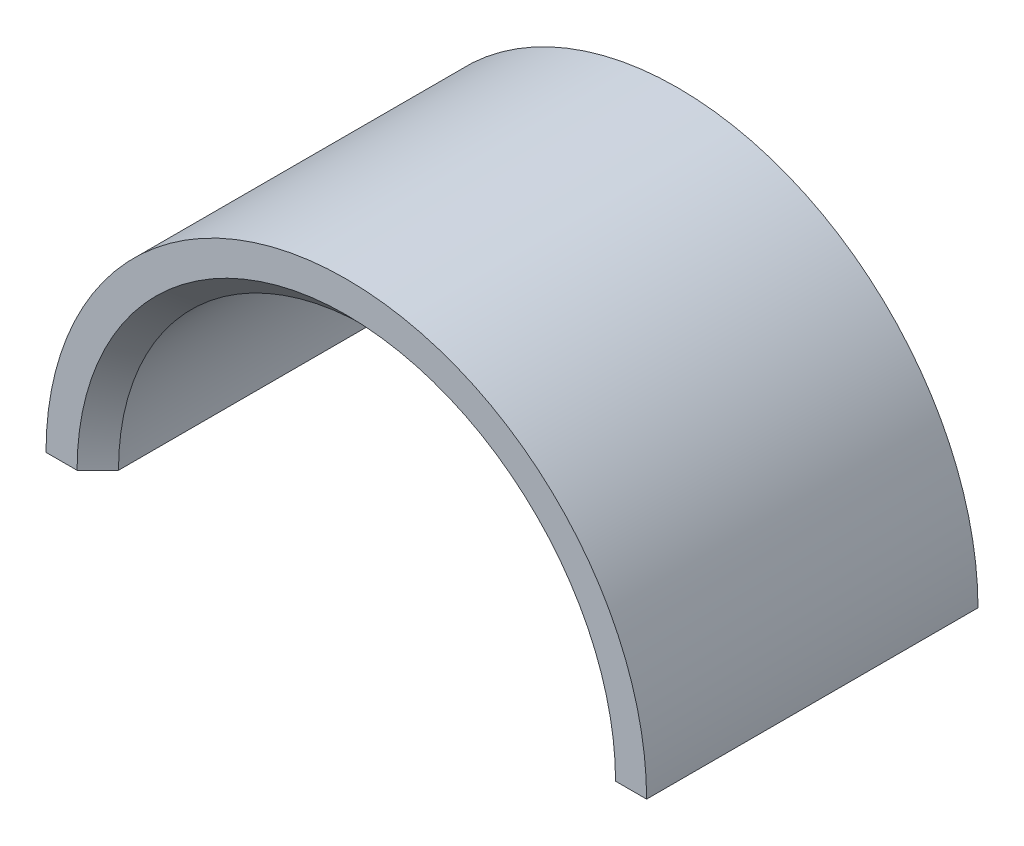
ISO-10303-21;
HEADER;
FILE_DESCRIPTION(('STEP AP214'),'2;1');
FILE_NAME('part.step','',(''),(''),'','','');
FILE_SCHEMA(('AUTOMOTIVE_DESIGN { 1 0 10303 214 1 1 1 1 }'));
ENDSEC;
DATA;
#1=APPLICATION_CONTEXT('core data for automotive mechanical design processes');
#2=APPLICATION_PROTOCOL_DEFINITION('international standard','automotive_design',2000,#1);
#3=PRODUCT_CONTEXT('',#1,'mechanical');
#4=PRODUCT('Part','Part','',(#3));
#5=PRODUCT_RELATED_PRODUCT_CATEGORY('part','',(#4));
#6=PRODUCT_DEFINITION_FORMATION('','',#4);
#7=PRODUCT_DEFINITION_CONTEXT('part definition',#1,'design');
#8=PRODUCT_DEFINITION('design','',#6,#7);
#9=PRODUCT_DEFINITION_SHAPE('','',#8);
#10=(LENGTH_UNIT() NAMED_UNIT(*) SI_UNIT(.MILLI.,.METRE.));
#11=(NAMED_UNIT(*) PLANE_ANGLE_UNIT() SI_UNIT($,.RADIAN.));
#12=(NAMED_UNIT(*) SI_UNIT($,.STERADIAN.) SOLID_ANGLE_UNIT());
#13=UNCERTAINTY_MEASURE_WITH_UNIT(LENGTH_MEASURE(1.E-05),#10,'distance_accuracy_value','');
#14=(GEOMETRIC_REPRESENTATION_CONTEXT(3) GLOBAL_UNCERTAINTY_ASSIGNED_CONTEXT((#13)) GLOBAL_UNIT_ASSIGNED_CONTEXT((#10,
#11,#12)) REPRESENTATION_CONTEXT('',''));
#15=CARTESIAN_POINT('',(0.,0.,0.));
#16=DIRECTION('',(0.,0.,1.));
#17=DIRECTION('',(1.,0.,0.));
#18=AXIS2_PLACEMENT_3D('',#15,#16,#17);
#19=CARTESIAN_POINT('',(34.3713198515824,-30.64120754575,14.01));
#20=DIRECTION('',(0.,-1.,0.));
#21=DIRECTION('',(0.,0.,-1.));
#22=AXIS2_PLACEMENT_3D('',#19,#20,#21);
#23=PLANE('',#22);
#24=DIRECTION('',(1.,0.,0.));
#25=VECTOR('',#24,1.);
#26=CARTESIAN_POINT('',(0.,-30.64120754575,14.));
#27=LINE('',#26,#25);
#28=CARTESIAN_POINT('',(-14.5,-30.64120754575,14.));
#29=VERTEX_POINT('',#28);
#30=CARTESIAN_POINT('',(-13.,-30.64120754575,14.));
#31=VERTEX_POINT('',#30);
#32=EDGE_CURVE('E95',#29,#31,#27,.T.);
#33=ORIENTED_EDGE('',*,*,#32,.F.);
#34=DIRECTION('',(0.,0.,-1.));
#35=VECTOR('',#34,1.);
#36=CARTESIAN_POINT('',(-14.5,-30.64120754575,14.01));
#37=LINE('',#36,#35);
#38=CARTESIAN_POINT('',(-14.5,-30.64120754575,-2.));
#39=VERTEX_POINT('',#38);
#40=EDGE_CURVE('E98',#39,#29,#37,.F.);
#41=ORIENTED_EDGE('',*,*,#40,.F.);
#42=DIRECTION('',(1.,0.,0.));
#43=VECTOR('',#42,1.);
#44=CARTESIAN_POINT('',(0.,-30.64120754575,-2.));
#45=LINE('',#44,#43);
#46=CARTESIAN_POINT('',(-13.,-30.64120754575,-2.));
#47=VERTEX_POINT('',#46);
#48=EDGE_CURVE('E131',#39,#47,#45,.T.);
#49=ORIENTED_EDGE('',*,*,#48,.T.);
#50=DIRECTION('',(-0.707106781186548,0.,-0.707106781186547));
#51=VECTOR('',#50,1.);
#52=CARTESIAN_POINT('',(0.,-30.64120754575,11.));
#53=LINE('',#52,#51);
#54=CARTESIAN_POINT('',(-12.,-30.64120754575,-0.99999999999999));
#55=VERTEX_POINT('',#54);
#56=EDGE_CURVE('E64',#55,#47,#53,.T.);
#57=ORIENTED_EDGE('',*,*,#56,.F.);
#58=DIRECTION('',(0.,0.,-1.));
#59=VECTOR('',#58,1.);
#60=CARTESIAN_POINT('',(-12.,-30.64120754575,12.));
#61=LINE('',#60,#59);
#62=CARTESIAN_POINT('',(-12.,-30.64120754575,13.));
#63=VERTEX_POINT('',#62);
#64=EDGE_CURVE('E129',#63,#55,#61,.T.);
#65=ORIENTED_EDGE('',*,*,#64,.F.);
#66=DIRECTION('',(0.707106781186553,0.,-0.707106781186542));
#67=VECTOR('',#66,1.);
#68=CARTESIAN_POINT('',(0.,-30.64120754575,1.00000000000018));
#69=LINE('',#68,#67);
#70=EDGE_CURVE('E99',#31,#63,#69,.T.);
#71=ORIENTED_EDGE('',*,*,#70,.F.);
#72=EDGE_LOOP('',(#33,#41,#49,#57,#65,#71));
#73=FACE_BOUND('',#72,.T.);
#74=ADVANCED_FACE('F39',(#73),#23,.T.);
#75=CARTESIAN_POINT('',(13.,-30.64120754575,14.));
#76=VERTEX_POINT('',#75);
#77=CARTESIAN_POINT('',(14.5,-30.64120754575,14.));
#78=VERTEX_POINT('',#77);
#79=EDGE_CURVE('E103',#76,#78,#27,.T.);
#80=ORIENTED_EDGE('',*,*,#79,.F.);
#81=DIRECTION('',(0.707106781186553,0.,0.707106781186542));
#82=VECTOR('',#81,1.);
#83=CARTESIAN_POINT('',(0.,-30.64120754575,1.00000000000018));
#84=LINE('',#83,#82);
#85=CARTESIAN_POINT('',(12.,-30.64120754575,13.));
#86=VERTEX_POINT('',#85);
#87=EDGE_CURVE('E113',#86,#76,#84,.T.);
#88=ORIENTED_EDGE('',*,*,#87,.F.);
#89=DIRECTION('',(0.,0.,-1.));
#90=VECTOR('',#89,1.);
#91=CARTESIAN_POINT('',(12.,-30.64120754575,12.));
#92=LINE('',#91,#90);
#93=CARTESIAN_POINT('',(12.,-30.64120754575,-0.99999999999999));
#94=VERTEX_POINT('',#93);
#95=EDGE_CURVE('E104',#94,#86,#92,.F.);
#96=ORIENTED_EDGE('',*,*,#95,.F.);
#97=DIRECTION('',(-0.707106781186548,0.,0.707106781186547));
#98=VECTOR('',#97,1.);
#99=CARTESIAN_POINT('',(0.,-30.64120754575,11.));
#100=LINE('',#99,#98);
#101=CARTESIAN_POINT('',(13.,-30.64120754575,-2.));
#102=VERTEX_POINT('',#101);
#103=EDGE_CURVE('E56',#102,#94,#100,.T.);
#104=ORIENTED_EDGE('',*,*,#103,.F.);
#105=CARTESIAN_POINT('',(14.5,-30.64120754575,-2.));
#106=VERTEX_POINT('',#105);
#107=EDGE_CURVE('E119',#102,#106,#45,.T.);
#108=ORIENTED_EDGE('',*,*,#107,.T.);
#109=DIRECTION('',(0.,0.,-1.));
#110=VECTOR('',#109,1.);
#111=CARTESIAN_POINT('',(14.5,-30.64120754575,14.01));
#112=LINE('',#111,#110);
#113=EDGE_CURVE('E43',#78,#106,#112,.T.);
#114=ORIENTED_EDGE('',*,*,#113,.F.);
#115=EDGE_LOOP('',(#80,#88,#96,#104,#108,#114));
#116=FACE_BOUND('',#115,.T.);
#117=ADVANCED_FACE('F144',(#116),#23,.T.);
#118=CARTESIAN_POINT('',(0.,-30.64120754575,14.01));
#119=DIRECTION('',(0.,0.,-1.));
#120=DIRECTION('',(-1.,0.,0.));
#121=AXIS2_PLACEMENT_3D('',#118,#119,#120);
#122=CYLINDRICAL_SURFACE('',#121,14.5);
#123=CARTESIAN_POINT('',(0.,-30.64120754575,14.));
#124=DIRECTION('',(0.,0.,1.));
#125=DIRECTION('',(1.,0.,0.));
#126=AXIS2_PLACEMENT_3D('',#123,#124,#125);
#127=CIRCLE('',#126,14.5);
#128=EDGE_CURVE('E107',#78,#29,#127,.T.);
#129=ORIENTED_EDGE('',*,*,#128,.F.);
#130=ORIENTED_EDGE('',*,*,#113,.T.);
#131=CARTESIAN_POINT('',(0.,-30.64120754575,-2.));
#132=DIRECTION('',(0.,0.,1.));
#133=DIRECTION('',(1.,0.,0.));
#134=AXIS2_PLACEMENT_3D('',#131,#132,#133);
#135=CIRCLE('',#134,14.5);
#136=EDGE_CURVE('E118',#106,#39,#135,.T.);
#137=ORIENTED_EDGE('',*,*,#136,.T.);
#138=ORIENTED_EDGE('',*,*,#40,.T.);
#139=EDGE_LOOP('',(#129,#130,#137,#138));
#140=FACE_BOUND('',#139,.T.);
#141=ADVANCED_FACE('F116',(#140),#122,.T.);
#142=CARTESIAN_POINT('',(0.,-30.64120754575,14.));
#143=DIRECTION('',(0.,0.,1.));
#144=DIRECTION('',(1.,0.,0.));
#145=AXIS2_PLACEMENT_3D('',#142,#143,#144);
#146=PLANE('',#145);
#147=ORIENTED_EDGE('',*,*,#128,.T.);
#148=ORIENTED_EDGE('',*,*,#32,.T.);
#149=CARTESIAN_POINT('',(0.,-30.64120754575,14.));
#150=DIRECTION('',(0.,0.,1.));
#151=DIRECTION('',(1.,0.,0.));
#152=AXIS2_PLACEMENT_3D('',#149,#150,#151);
#153=CIRCLE('',#152,13.);
#154=EDGE_CURVE('E135',#31,#76,#153,.F.);
#155=ORIENTED_EDGE('',*,*,#154,.T.);
#156=ORIENTED_EDGE('',*,*,#79,.T.);
#157=EDGE_LOOP('',(#147,#148,#155,#156));
#158=FACE_BOUND('',#157,.T.);
#159=ADVANCED_FACE('F108',(#158),#146,.T.);
#160=CARTESIAN_POINT('',(0.,-30.64120754575,-2.));
#161=DIRECTION('',(0.,0.,1.));
#162=DIRECTION('',(1.,0.,0.));
#163=AXIS2_PLACEMENT_3D('',#160,#161,#162);
#164=PLANE('',#163);
#165=ORIENTED_EDGE('',*,*,#48,.F.);
#166=ORIENTED_EDGE('',*,*,#136,.F.);
#167=ORIENTED_EDGE('',*,*,#107,.F.);
#168=CARTESIAN_POINT('',(0.,-30.64120754575,-2.));
#169=DIRECTION('',(0.,0.,1.));
#170=DIRECTION('',(1.,0.,0.));
#171=AXIS2_PLACEMENT_3D('',#168,#169,#170);
#172=CIRCLE('',#171,13.);
#173=EDGE_CURVE('E123',#102,#47,#172,.T.);
#174=ORIENTED_EDGE('',*,*,#173,.T.);
#175=EDGE_LOOP('',(#165,#166,#167,#174));
#176=FACE_BOUND('',#175,.T.);
#177=ADVANCED_FACE('F41',(#176),#164,.F.);
#178=CARTESIAN_POINT('',(0.,-30.64120754575,12.));
#179=DIRECTION('',(0.,0.,-1.));
#180=DIRECTION('',(-1.,0.,0.));
#181=AXIS2_PLACEMENT_3D('',#178,#179,#180);
#182=CYLINDRICAL_SURFACE('',#181,12.);
#183=CARTESIAN_POINT('',(0.,-30.64120754575,13.));
#184=DIRECTION('',(0.,0.,1.));
#185=DIRECTION('',(1.,0.,0.));
#186=AXIS2_PLACEMENT_3D('',#183,#184,#185);
#187=CIRCLE('',#186,12.);
#188=EDGE_CURVE('E48',#86,#63,#187,.T.);
#189=ORIENTED_EDGE('',*,*,#188,.T.);
#190=ORIENTED_EDGE('',*,*,#64,.T.);
#191=CARTESIAN_POINT('',(0.,-30.64120754575,-0.99999999999999));
#192=DIRECTION('',(0.,0.,1.));
#193=DIRECTION('',(1.,0.,0.));
#194=AXIS2_PLACEMENT_3D('',#191,#192,#193);
#195=CIRCLE('',#194,12.);
#196=EDGE_CURVE('E11',#55,#94,#195,.F.);
#197=ORIENTED_EDGE('',*,*,#196,.T.);
#198=ORIENTED_EDGE('',*,*,#95,.T.);
#199=EDGE_LOOP('',(#189,#190,#197,#198));
#200=FACE_BOUND('',#199,.T.);
#201=ADVANCED_FACE('F140',(#200),#182,.F.);
#202=CARTESIAN_POINT('',(0.,-30.64120754575,-2.));
#203=DIRECTION('',(0.,0.,-1.));
#204=DIRECTION('',(-1.,0.,0.));
#205=AXIS2_PLACEMENT_3D('',#202,#203,#204);
#206=CONICAL_SURFACE('',#205,13.,0.785398163397448);
#207=ORIENTED_EDGE('',*,*,#196,.F.);
#208=ORIENTED_EDGE('',*,*,#56,.T.);
#209=ORIENTED_EDGE('',*,*,#173,.F.);
#210=ORIENTED_EDGE('',*,*,#103,.T.);
#211=EDGE_LOOP('',(#207,#208,#209,#210));
#212=FACE_BOUND('',#211,.T.);
#213=ADVANCED_FACE('F147',(#212),#206,.F.);
#214=CARTESIAN_POINT('',(0.,-30.64120754575,13.));
#215=DIRECTION('',(0.,0.,1.));
#216=DIRECTION('',(1.,0.,0.));
#217=AXIS2_PLACEMENT_3D('',#214,#215,#216);
#218=CONICAL_SURFACE('',#217,12.,0.785398163397456);
#219=ORIENTED_EDGE('',*,*,#188,.F.);
#220=ORIENTED_EDGE('',*,*,#87,.T.);
#221=ORIENTED_EDGE('',*,*,#154,.F.);
#222=ORIENTED_EDGE('',*,*,#70,.T.);
#223=EDGE_LOOP('',(#219,#220,#221,#222));
#224=FACE_BOUND('',#223,.T.);
#225=ADVANCED_FACE('F142',(#224),#218,.F.);
#226=CLOSED_SHELL('',(#74,#117,#141,#159,#177,#201,#213,#225));
#227=MANIFOLD_SOLID_BREP('B2',#226);
#228=ADVANCED_BREP_SHAPE_REPRESENTATION('',(#18,#227),#14);
#229=SHAPE_DEFINITION_REPRESENTATION(#9,#228);
ENDSEC;
END-ISO-10303-21;
